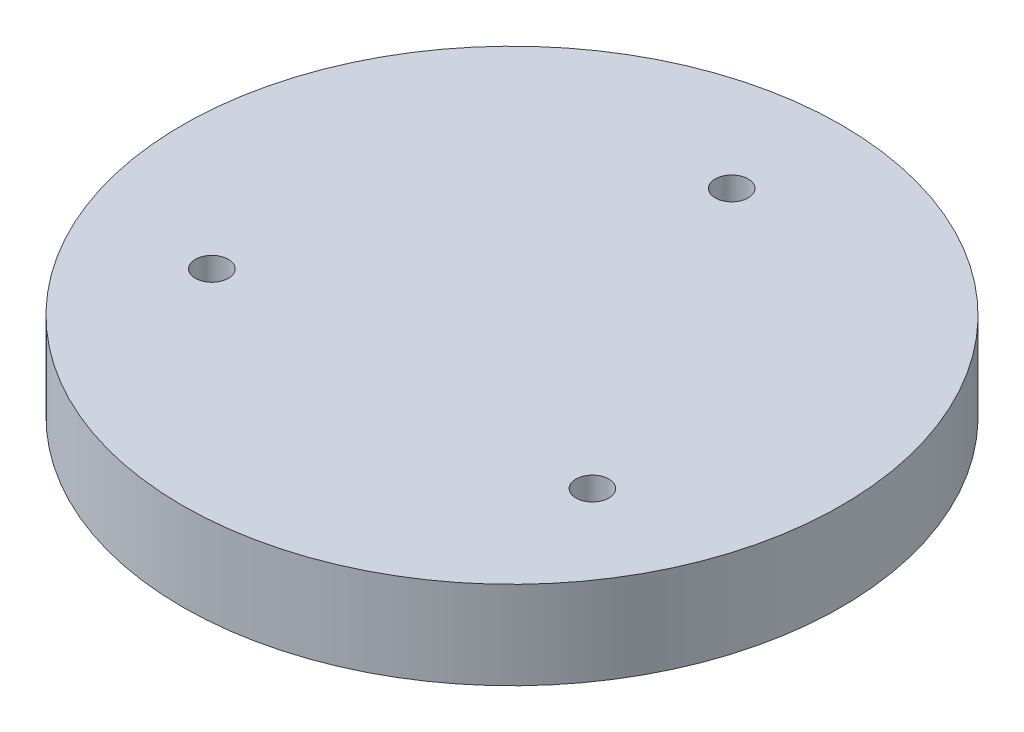
ISO-10303-21;
HEADER;
FILE_DESCRIPTION(('STEP AP214'),'2;1');
FILE_NAME('part.step','',(''),(''),'','','');
FILE_SCHEMA(('AUTOMOTIVE_DESIGN { 1 0 10303 214 1 1 1 1 }'));
ENDSEC;
DATA;
#1=APPLICATION_CONTEXT('core data for automotive mechanical design processes');
#2=APPLICATION_PROTOCOL_DEFINITION('international standard','automotive_design',2000,#1);
#3=PRODUCT_CONTEXT('',#1,'mechanical');
#4=PRODUCT('Part','Part','',(#3));
#5=PRODUCT_RELATED_PRODUCT_CATEGORY('part','',(#4));
#6=PRODUCT_DEFINITION_FORMATION('','',#4);
#7=PRODUCT_DEFINITION_CONTEXT('part definition',#1,'design');
#8=PRODUCT_DEFINITION('design','',#6,#7);
#9=PRODUCT_DEFINITION_SHAPE('','',#8);
#10=(LENGTH_UNIT() NAMED_UNIT(*) SI_UNIT(.MILLI.,.METRE.));
#11=(NAMED_UNIT(*) PLANE_ANGLE_UNIT() SI_UNIT($,.RADIAN.));
#12=(NAMED_UNIT(*) SI_UNIT($,.STERADIAN.) SOLID_ANGLE_UNIT());
#13=UNCERTAINTY_MEASURE_WITH_UNIT(LENGTH_MEASURE(1.E-05),#10,'distance_accuracy_value','');
#14=(GEOMETRIC_REPRESENTATION_CONTEXT(3) GLOBAL_UNCERTAINTY_ASSIGNED_CONTEXT((#13)) GLOBAL_UNIT_ASSIGNED_CONTEXT((#10,
#11,#12)) REPRESENTATION_CONTEXT('',''));
#15=CARTESIAN_POINT('',(0.,0.,0.));
#16=DIRECTION('',(0.,0.,1.));
#17=DIRECTION('',(1.,0.,0.));
#18=AXIS2_PLACEMENT_3D('',#15,#16,#17);
#19=CARTESIAN_POINT('',(0.,8.,0.));
#20=DIRECTION('',(0.,-1.,0.));
#21=DIRECTION('',(0.,0.,-1.));
#22=AXIS2_PLACEMENT_3D('',#19,#20,#21);
#23=CYLINDRICAL_SURFACE('',#22,30.);
#24=CARTESIAN_POINT('',(0.,8.,0.));
#25=DIRECTION('',(0.,1.,0.));
#26=DIRECTION('',(0.,0.,1.));
#27=AXIS2_PLACEMENT_3D('',#24,#25,#26);
#28=CIRCLE('',#27,30.);
#29=CARTESIAN_POINT('',(0.,8.,30.));
#30=VERTEX_POINT('',#29);
#31=EDGE_CURVE('E10',#30,#30,#28,.T.);
#32=ORIENTED_EDGE('',*,*,#31,.F.);
#33=EDGE_LOOP('',(#32));
#34=FACE_BOUND('',#33,.T.);
#35=CARTESIAN_POINT('',(0.,0.,0.));
#36=DIRECTION('',(0.,1.,0.));
#37=DIRECTION('',(0.,0.,1.));
#38=AXIS2_PLACEMENT_3D('',#35,#36,#37);
#39=CIRCLE('',#38,30.);
#40=CARTESIAN_POINT('',(0.,0.,30.));
#41=VERTEX_POINT('',#40);
#42=EDGE_CURVE('E36',#41,#41,#39,.T.);
#43=ORIENTED_EDGE('',*,*,#42,.T.);
#44=EDGE_LOOP('',(#43));
#45=FACE_BOUND('',#44,.T.);
#46=ADVANCED_FACE('F33',(#34,#45),#23,.T.);
#47=CARTESIAN_POINT('',(0.,8.,0.));
#48=DIRECTION('',(0.,1.,0.));
#49=DIRECTION('',(0.,0.,1.));
#50=AXIS2_PLACEMENT_3D('',#47,#48,#49);
#51=PLANE('',#50);
#52=CARTESIAN_POINT('',(0.,8.,-20.));
#53=DIRECTION('',(0.,1.,0.));
#54=DIRECTION('',(0.,0.,1.));
#55=AXIS2_PLACEMENT_3D('',#52,#53,#54);
#56=CIRCLE('',#55,1.5);
#57=CARTESIAN_POINT('',(0.,8.,-18.5));
#58=VERTEX_POINT('',#57);
#59=EDGE_CURVE('E57',#58,#58,#56,.T.);
#60=ORIENTED_EDGE('',*,*,#59,.F.);
#61=EDGE_LOOP('',(#60));
#62=FACE_BOUND('',#61,.T.);
#63=CARTESIAN_POINT('',(-17.3205080756875,8.,10.0000000000007));
#64=DIRECTION('',(0.,1.,0.));
#65=DIRECTION('',(0.,0.,1.));
#66=AXIS2_PLACEMENT_3D('',#63,#64,#65);
#67=CIRCLE('',#66,1.50000000000161);
#68=CARTESIAN_POINT('',(-17.3205080756875,8.,11.5000000000024));
#69=VERTEX_POINT('',#68);
#70=EDGE_CURVE('E54',#69,#69,#67,.T.);
#71=ORIENTED_EDGE('',*,*,#70,.F.);
#72=EDGE_LOOP('',(#71));
#73=FACE_BOUND('',#72,.T.);
#74=CARTESIAN_POINT('',(17.3205080756901,8.,9.99999999999925));
#75=DIRECTION('',(0.,1.,0.));
#76=DIRECTION('',(0.,0.,1.));
#77=AXIS2_PLACEMENT_3D('',#74,#75,#76);
#78=CIRCLE('',#77,1.50000000000111);
#79=CARTESIAN_POINT('',(17.3205080756901,8.,11.5000000000004));
#80=VERTEX_POINT('',#79);
#81=EDGE_CURVE('E48',#80,#80,#78,.T.);
#82=ORIENTED_EDGE('',*,*,#81,.F.);
#83=EDGE_LOOP('',(#82));
#84=FACE_BOUND('',#83,.T.);
#85=ORIENTED_EDGE('',*,*,#31,.T.);
#86=EDGE_LOOP('',(#85));
#87=FACE_BOUND('',#86,.T.);
#88=ADVANCED_FACE('F73',(#62,#73,#84,#87),#51,.T.);
#89=CARTESIAN_POINT('',(0.,0.,0.));
#90=DIRECTION('',(0.,1.,0.));
#91=DIRECTION('',(0.,0.,1.));
#92=AXIS2_PLACEMENT_3D('',#89,#90,#91);
#93=PLANE('',#92);
#94=CARTESIAN_POINT('',(0.,0.,-20.));
#95=DIRECTION('',(0.,1.,0.));
#96=DIRECTION('',(0.,0.,1.));
#97=AXIS2_PLACEMENT_3D('',#94,#95,#96);
#98=CIRCLE('',#97,1.5);
#99=CARTESIAN_POINT('',(0.,0.,-18.5));
#100=VERTEX_POINT('',#99);
#101=EDGE_CURVE('E43',#100,#100,#98,.T.);
#102=ORIENTED_EDGE('',*,*,#101,.T.);
#103=EDGE_LOOP('',(#102));
#104=FACE_BOUND('',#103,.T.);
#105=CARTESIAN_POINT('',(-17.3205080756875,0.,10.0000000000007));
#106=DIRECTION('',(0.,1.,0.));
#107=DIRECTION('',(0.,0.,1.));
#108=AXIS2_PLACEMENT_3D('',#105,#106,#107);
#109=CIRCLE('',#108,1.50000000000161);
#110=CARTESIAN_POINT('',(-17.3205080756875,0.,11.5000000000024));
#111=VERTEX_POINT('',#110);
#112=EDGE_CURVE('E51',#111,#111,#109,.T.);
#113=ORIENTED_EDGE('',*,*,#112,.T.);
#114=EDGE_LOOP('',(#113));
#115=FACE_BOUND('',#114,.T.);
#116=CARTESIAN_POINT('',(17.3205080756901,0.,9.99999999999925));
#117=DIRECTION('',(0.,1.,0.));
#118=DIRECTION('',(0.,0.,1.));
#119=AXIS2_PLACEMENT_3D('',#116,#117,#118);
#120=CIRCLE('',#119,1.50000000000111);
#121=CARTESIAN_POINT('',(17.3205080756901,0.,11.5000000000004));
#122=VERTEX_POINT('',#121);
#123=EDGE_CURVE('E45',#122,#122,#120,.T.);
#124=ORIENTED_EDGE('',*,*,#123,.T.);
#125=EDGE_LOOP('',(#124));
#126=FACE_BOUND('',#125,.T.);
#127=ORIENTED_EDGE('',*,*,#42,.F.);
#128=EDGE_LOOP('',(#127));
#129=FACE_BOUND('',#128,.T.);
#130=ADVANCED_FACE('F63',(#104,#115,#126,#129),#93,.F.);
#131=CARTESIAN_POINT('',(17.3205080756901,0.,9.99999999999925));
#132=DIRECTION('',(0.,1.,0.));
#133=DIRECTION('',(0.,0.,1.));
#134=AXIS2_PLACEMENT_3D('',#131,#132,#133);
#135=CYLINDRICAL_SURFACE('',#134,1.50000000000111);
#136=ORIENTED_EDGE('',*,*,#123,.F.);
#137=EDGE_LOOP('',(#136));
#138=FACE_BOUND('',#137,.T.);
#139=ORIENTED_EDGE('',*,*,#81,.T.);
#140=EDGE_LOOP('',(#139));
#141=FACE_BOUND('',#140,.T.);
#142=ADVANCED_FACE('F81',(#138,#141),#135,.F.);
#143=CARTESIAN_POINT('',(-17.3205080756875,0.,10.0000000000007));
#144=DIRECTION('',(0.,1.,0.));
#145=DIRECTION('',(0.,0.,1.));
#146=AXIS2_PLACEMENT_3D('',#143,#144,#145);
#147=CYLINDRICAL_SURFACE('',#146,1.50000000000161);
#148=ORIENTED_EDGE('',*,*,#112,.F.);
#149=EDGE_LOOP('',(#148));
#150=FACE_BOUND('',#149,.T.);
#151=ORIENTED_EDGE('',*,*,#70,.T.);
#152=EDGE_LOOP('',(#151));
#153=FACE_BOUND('',#152,.T.);
#154=ADVANCED_FACE('F69',(#150,#153),#147,.F.);
#155=CARTESIAN_POINT('',(0.,0.,-20.));
#156=DIRECTION('',(0.,1.,0.));
#157=DIRECTION('',(0.,0.,1.));
#158=AXIS2_PLACEMENT_3D('',#155,#156,#157);
#159=CYLINDRICAL_SURFACE('',#158,1.5);
#160=ORIENTED_EDGE('',*,*,#101,.F.);
#161=EDGE_LOOP('',(#160));
#162=FACE_BOUND('',#161,.T.);
#163=ORIENTED_EDGE('',*,*,#59,.T.);
#164=EDGE_LOOP('',(#163));
#165=FACE_BOUND('',#164,.T.);
#166=ADVANCED_FACE('F66',(#162,#165),#159,.F.);
#167=CLOSED_SHELL('',(#46,#88,#130,#142,#154,#166));
#168=MANIFOLD_SOLID_BREP('B2',#167);
#169=ADVANCED_BREP_SHAPE_REPRESENTATION('',(#18,#168),#14);
#170=SHAPE_DEFINITION_REPRESENTATION(#9,#169);
ENDSEC;
END-ISO-10303-21;
